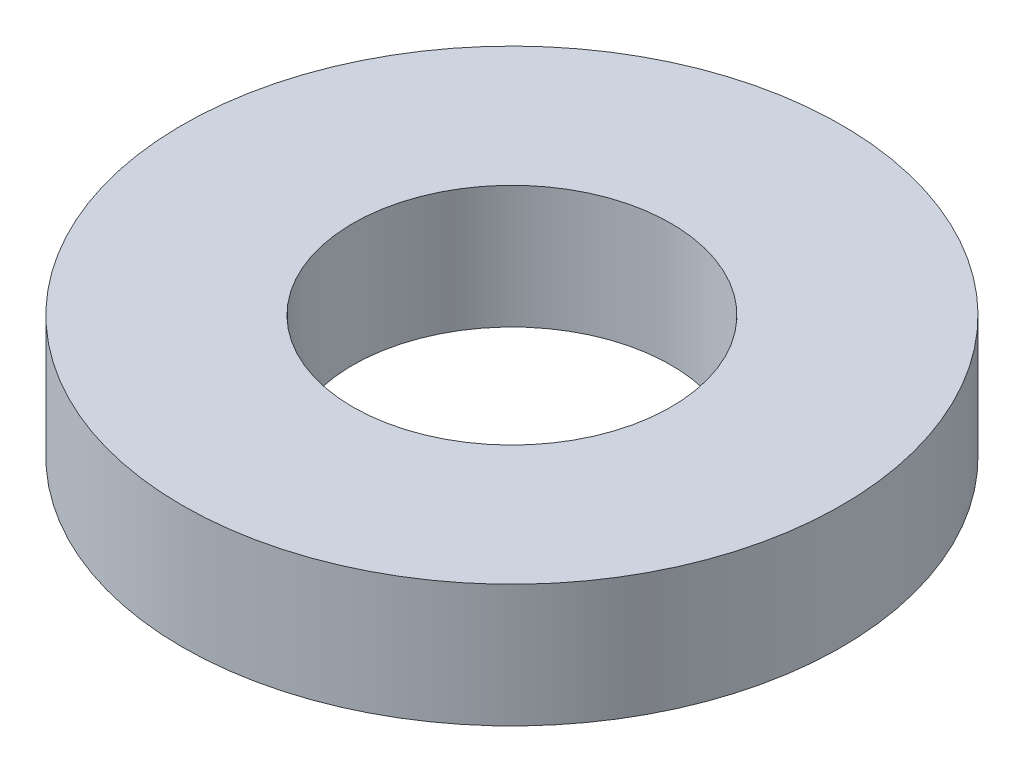
ISO-10303-21;
HEADER;
FILE_DESCRIPTION(('STEP AP214'),'2;1');
FILE_NAME('part.step','',(''),(''),'','','');
FILE_SCHEMA(('AUTOMOTIVE_DESIGN { 1 0 10303 214 1 1 1 1 }'));
ENDSEC;
DATA;
#1=APPLICATION_CONTEXT('core data for automotive mechanical design processes');
#2=APPLICATION_PROTOCOL_DEFINITION('international standard','automotive_design',2000,#1);
#3=PRODUCT_CONTEXT('',#1,'mechanical');
#4=PRODUCT('Part','Part','',(#3));
#5=PRODUCT_RELATED_PRODUCT_CATEGORY('part','',(#4));
#6=PRODUCT_DEFINITION_FORMATION('','',#4);
#7=PRODUCT_DEFINITION_CONTEXT('part definition',#1,'design');
#8=PRODUCT_DEFINITION('design','',#6,#7);
#9=PRODUCT_DEFINITION_SHAPE('','',#8);
#10=(LENGTH_UNIT() NAMED_UNIT(*) SI_UNIT(.MILLI.,.METRE.));
#11=(NAMED_UNIT(*) PLANE_ANGLE_UNIT() SI_UNIT($,.RADIAN.));
#12=(NAMED_UNIT(*) SI_UNIT($,.STERADIAN.) SOLID_ANGLE_UNIT());
#13=UNCERTAINTY_MEASURE_WITH_UNIT(LENGTH_MEASURE(1.E-05),#10,'distance_accuracy_value','');
#14=(GEOMETRIC_REPRESENTATION_CONTEXT(3) GLOBAL_UNCERTAINTY_ASSIGNED_CONTEXT((#13)) GLOBAL_UNIT_ASSIGNED_CONTEXT((#10,
#11,#12)) REPRESENTATION_CONTEXT('',''));
#15=CARTESIAN_POINT('',(0.,0.,0.));
#16=DIRECTION('',(0.,0.,1.));
#17=DIRECTION('',(1.,0.,0.));
#18=AXIS2_PLACEMENT_3D('',#15,#16,#17);
#19=CARTESIAN_POINT('',(0.,27.,0.));
#20=DIRECTION('',(0.,-1.,0.));
#21=DIRECTION('',(0.,0.,-1.));
#22=AXIS2_PLACEMENT_3D('',#19,#20,#21);
#23=CYLINDRICAL_SURFACE('',#22,72.5);
#24=CARTESIAN_POINT('',(0.,27.,0.));
#25=DIRECTION('',(0.,1.,0.));
#26=DIRECTION('',(0.,0.,1.));
#27=AXIS2_PLACEMENT_3D('',#24,#25,#26);
#28=CIRCLE('',#27,72.5);
#29=CARTESIAN_POINT('',(0.,27.,72.5));
#30=VERTEX_POINT('',#29);
#31=EDGE_CURVE('E10',#30,#30,#28,.T.);
#32=ORIENTED_EDGE('',*,*,#31,.F.);
#33=EDGE_LOOP('',(#32));
#34=FACE_BOUND('',#33,.T.);
#35=CARTESIAN_POINT('',(0.,0.,0.));
#36=DIRECTION('',(0.,1.,0.));
#37=DIRECTION('',(0.,0.,1.));
#38=AXIS2_PLACEMENT_3D('',#35,#36,#37);
#39=CIRCLE('',#38,72.5);
#40=CARTESIAN_POINT('',(0.,0.,72.5));
#41=VERTEX_POINT('',#40);
#42=EDGE_CURVE('E37',#41,#41,#39,.T.);
#43=ORIENTED_EDGE('',*,*,#42,.T.);
#44=EDGE_LOOP('',(#43));
#45=FACE_BOUND('',#44,.T.);
#46=ADVANCED_FACE('F40',(#34,#45),#23,.T.);
#47=CARTESIAN_POINT('',(0.,27.,0.));
#48=DIRECTION('',(0.,1.,0.));
#49=DIRECTION('',(0.,0.,1.));
#50=AXIS2_PLACEMENT_3D('',#47,#48,#49);
#51=PLANE('',#50);
#52=CARTESIAN_POINT('',(0.,27.,0.));
#53=DIRECTION('',(0.,1.,0.));
#54=DIRECTION('',(0.,0.,1.));
#55=AXIS2_PLACEMENT_3D('',#52,#53,#54);
#56=CIRCLE('',#55,35.);
#57=CARTESIAN_POINT('',(0.,27.,35.));
#58=VERTEX_POINT('',#57);
#59=EDGE_CURVE('E50',#58,#58,#56,.T.);
#60=ORIENTED_EDGE('',*,*,#59,.F.);
#61=EDGE_LOOP('',(#60));
#62=FACE_BOUND('',#61,.T.);
#63=ORIENTED_EDGE('',*,*,#31,.T.);
#64=EDGE_LOOP('',(#63));
#65=FACE_BOUND('',#64,.T.);
#66=ADVANCED_FACE('F59',(#62,#65),#51,.T.);
#67=CARTESIAN_POINT('',(0.,0.,0.));
#68=DIRECTION('',(0.,1.,0.));
#69=DIRECTION('',(0.,0.,1.));
#70=AXIS2_PLACEMENT_3D('',#67,#68,#69);
#71=PLANE('',#70);
#72=CARTESIAN_POINT('',(0.,0.,0.));
#73=DIRECTION('',(0.,1.,0.));
#74=DIRECTION('',(0.,0.,1.));
#75=AXIS2_PLACEMENT_3D('',#72,#73,#74);
#76=CIRCLE('',#75,35.);
#77=CARTESIAN_POINT('',(0.,0.,35.));
#78=VERTEX_POINT('',#77);
#79=EDGE_CURVE('E47',#78,#78,#76,.T.);
#80=ORIENTED_EDGE('',*,*,#79,.T.);
#81=EDGE_LOOP('',(#80));
#82=FACE_BOUND('',#81,.T.);
#83=ORIENTED_EDGE('',*,*,#42,.F.);
#84=EDGE_LOOP('',(#83));
#85=FACE_BOUND('',#84,.T.);
#86=ADVANCED_FACE('F58',(#82,#85),#71,.F.);
#87=CARTESIAN_POINT('',(0.,27.,0.));
#88=DIRECTION('',(0.,-1.,0.));
#89=DIRECTION('',(0.,0.,-1.));
#90=AXIS2_PLACEMENT_3D('',#87,#88,#89);
#91=CYLINDRICAL_SURFACE('',#90,35.);
#92=ORIENTED_EDGE('',*,*,#59,.T.);
#93=EDGE_LOOP('',(#92));
#94=FACE_BOUND('',#93,.T.);
#95=ORIENTED_EDGE('',*,*,#79,.F.);
#96=EDGE_LOOP('',(#95));
#97=FACE_BOUND('',#96,.T.);
#98=ADVANCED_FACE('F54',(#94,#97),#91,.F.);
#99=CLOSED_SHELL('',(#46,#66,#86,#98));
#100=MANIFOLD_SOLID_BREP('B2',#99);
#101=ADVANCED_BREP_SHAPE_REPRESENTATION('',(#18,#100),#14);
#102=SHAPE_DEFINITION_REPRESENTATION(#9,#101);
ENDSEC;
END-ISO-10303-21;
